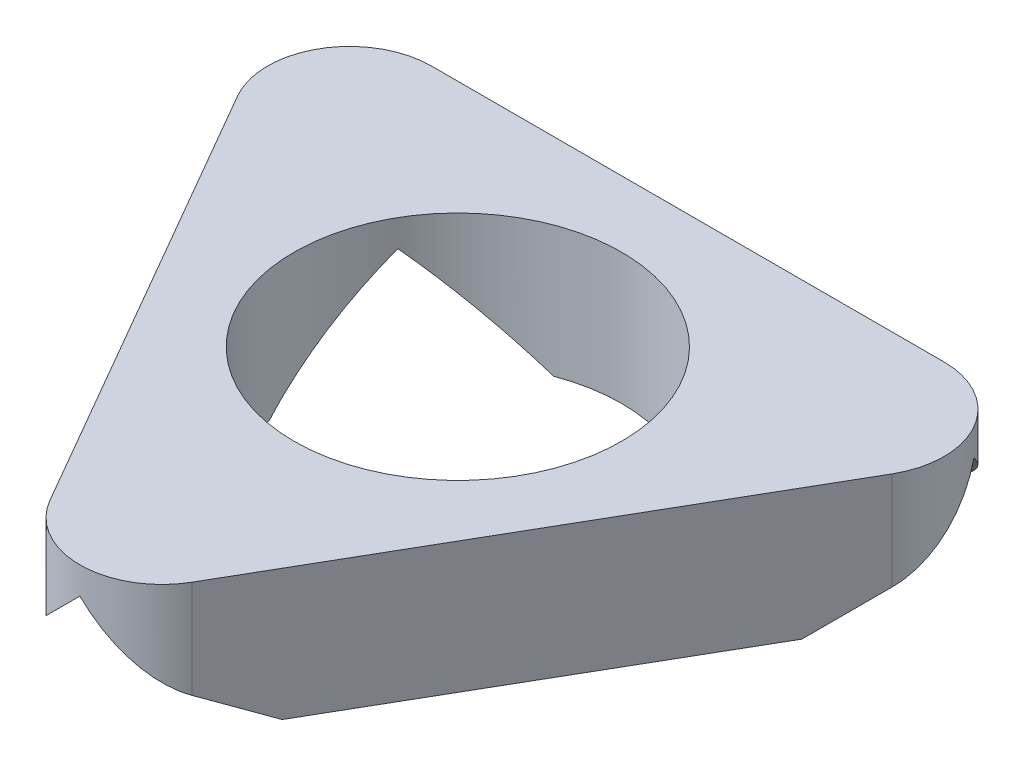
ISO-10303-21;
HEADER;
FILE_DESCRIPTION(('STEP AP214'),'2;1');
FILE_NAME('part.step','',(''),(''),'','','');
FILE_SCHEMA(('AUTOMOTIVE_DESIGN { 1 0 10303 214 1 1 1 1 }'));
ENDSEC;
DATA;
#1=APPLICATION_CONTEXT('core data for automotive mechanical design processes');
#2=APPLICATION_PROTOCOL_DEFINITION('international standard','automotive_design',2000,#1);
#3=PRODUCT_CONTEXT('',#1,'mechanical');
#4=PRODUCT('Part','Part','',(#3));
#5=PRODUCT_RELATED_PRODUCT_CATEGORY('part','',(#4));
#6=PRODUCT_DEFINITION_FORMATION('','',#4);
#7=PRODUCT_DEFINITION_CONTEXT('part definition',#1,'design');
#8=PRODUCT_DEFINITION('design','',#6,#7);
#9=PRODUCT_DEFINITION_SHAPE('','',#8);
#10=(LENGTH_UNIT() NAMED_UNIT(*) SI_UNIT(.MILLI.,.METRE.));
#11=(NAMED_UNIT(*) PLANE_ANGLE_UNIT() SI_UNIT($,.RADIAN.));
#12=(NAMED_UNIT(*) SI_UNIT($,.STERADIAN.) SOLID_ANGLE_UNIT());
#13=UNCERTAINTY_MEASURE_WITH_UNIT(LENGTH_MEASURE(1.E-05),#10,'distance_accuracy_value','');
#14=(GEOMETRIC_REPRESENTATION_CONTEXT(3) GLOBAL_UNCERTAINTY_ASSIGNED_CONTEXT((#13)) GLOBAL_UNIT_ASSIGNED_CONTEXT((#10,
#11,#12)) REPRESENTATION_CONTEXT('',''));
#15=CARTESIAN_POINT('',(0.,0.,0.));
#16=DIRECTION('',(0.,0.,1.));
#17=DIRECTION('',(1.,0.,0.));
#18=AXIS2_PLACEMENT_3D('',#15,#16,#17);
#19=CARTESIAN_POINT('',(-3.02097763799664,0.,-4.56619239928937));
#20=DIRECTION('',(0.,-1.,0.));
#21=DIRECTION('',(0.,0.,-1.));
#22=AXIS2_PLACEMENT_3D('',#19,#20,#21);
#23=PLANE('',#22);
#24=CARTESIAN_POINT('',(4.80389534308115,0.,-0.0484998772894646));
#25=DIRECTION('',(0.,1.,0.));
#26=DIRECTION('',(0.,0.,1.));
#27=AXIS2_PLACEMENT_3D('',#24,#25,#26);
#28=CIRCLE('',#27,5.);
#29=CARTESIAN_POINT('',(7.97889534308112,0.,3.81406080184558));
#30=VERTEX_POINT('',#29);
#31=CARTESIAN_POINT('',(9.73647101487096,0.,0.76985044015853));
#32=VERTEX_POINT('',#31);
#33=EDGE_CURVE('E253',#30,#32,#28,.T.);
#34=ORIENTED_EDGE('',*,*,#33,.T.);
#35=DIRECTION('',(-0.86602540378444,0.,0.499999999999998));
#36=VECTOR('',#35,1.);
#37=CARTESIAN_POINT('',(17.1738000788896,0.,-3.52409349700445));
#38=LINE('',#37,#36);
#39=CARTESIAN_POINT('',(13.7838953430815,0.,-1.56693108525845));
#40=VERTEX_POINT('',#39);
#41=EDGE_CURVE('E189',#40,#32,#38,.T.);
#42=ORIENTED_EDGE('',*,*,#41,.F.);
#43=DIRECTION('',(0.500000000000008,0.,-0.866025403784434));
#44=VECTOR('',#43,1.);
#45=CARTESIAN_POINT('',(6.96895885254223,0.,10.2368851667104));
#46=LINE('',#45,#44);
#47=CARTESIAN_POINT('',(7.97889534308109,0.,8.48762385267935));
#48=VERTEX_POINT('',#47);
#49=EDGE_CURVE('E183',#48,#40,#46,.T.);
#50=ORIENTED_EDGE('',*,*,#49,.F.);
#51=DIRECTION('',(0.,0.,-1.));
#52=VECTOR('',#51,1.);
#53=CARTESIAN_POINT('',(7.97889534308107,0.,11.4868851667105));
#54=LINE('',#53,#52);
#55=EDGE_CURVE('E46',#48,#30,#54,.T.);
#56=ORIENTED_EDGE('',*,*,#55,.T.);
#57=EDGE_LOOP('',(#34,#42,#50,#56));
#58=FACE_BOUND('',#57,.T.);
#59=ADVANCED_FACE('F31',(#58),#23,.T.);
#60=CARTESIAN_POINT('',(-0.12868032870865,0.,0.769850440158632));
#61=VERTEX_POINT('',#60);
#62=CARTESIAN_POINT('',(1.6288953430812,0.,3.8140608018456));
#63=VERTEX_POINT('',#62);
#64=EDGE_CURVE('E250',#61,#63,#28,.T.);
#65=ORIENTED_EDGE('',*,*,#64,.T.);
#66=DIRECTION('',(0.,0.,-1.));
#67=VECTOR('',#66,1.);
#68=CARTESIAN_POINT('',(1.62889534308115,0.,11.4868851667104));
#69=LINE('',#68,#67);
#70=CARTESIAN_POINT('',(1.62889534308117,0.,8.48762385267923));
#71=VERTEX_POINT('',#70);
#72=EDGE_CURVE('E279',#71,#63,#69,.T.);
#73=ORIENTED_EDGE('',*,*,#72,.F.);
#74=DIRECTION('',(0.499999999999998,0.,0.86602540378444));
#75=VECTOR('',#74,1.);
#76=CARTESIAN_POINT('',(-5.18604114745774,0.,-3.31619239928936));
#77=LINE('',#76,#75);
#78=CARTESIAN_POINT('',(-4.17610465691882,0.,-1.56693108525813));
#79=VERTEX_POINT('',#78);
#80=EDGE_CURVE('E191',#79,#71,#77,.T.);
#81=ORIENTED_EDGE('',*,*,#80,.F.);
#82=DIRECTION('',(0.86602540378444,0.,0.499999999999998));
#83=VECTOR('',#82,1.);
#84=CARTESIAN_POINT('',(-7.56600939272721,0.,-3.52409349700428));
#85=LINE('',#84,#83);
#86=EDGE_CURVE('E233',#79,#61,#85,.T.);
#87=ORIENTED_EDGE('',*,*,#86,.T.);
#88=EDGE_LOOP('',(#65,#73,#81,#87));
#89=FACE_BOUND('',#88,.T.);
#90=ADVANCED_FACE('F277',(#89),#23,.T.);
#91=CARTESIAN_POINT('',(4.80389534308115,4.,-0.0484998772894646));
#92=DIRECTION('',(0.,-1.,0.));
#93=DIRECTION('',(0.,0.,-1.));
#94=AXIS2_PLACEMENT_3D('',#91,#92,#93);
#95=CYLINDRICAL_SURFACE('',#94,5.);
#96=CARTESIAN_POINT('',(4.80389534308115,4.,-0.0484998772894646));
#97=DIRECTION('',(0.,1.,0.));
#98=DIRECTION('',(0.,0.,1.));
#99=AXIS2_PLACEMENT_3D('',#96,#97,#98);
#100=CIRCLE('',#99,5.);
#101=CARTESIAN_POINT('',(4.80389534308115,4.,4.95150012271054));
#102=VERTEX_POINT('',#101);
#103=EDGE_CURVE('E196',#102,#102,#100,.T.);
#104=ORIENTED_EDGE('',*,*,#103,.T.);
#105=EDGE_LOOP('',(#104));
#106=FACE_BOUND('',#105,.T.);
#107=CARTESIAN_POINT('',(4.80389534308115,3.17499999999998,-0.0484998772894646));
#108=DIRECTION('',(-0.353553390593271,0.70710678118655,-0.612372435695793));
#109=DIRECTION('',(-0.353553390593274,-0.707106781186545,-0.612372435695798));
#110=AXIS2_PLACEMENT_3D('',#107,#108,#109);
#111=ELLIPSE('',#110,7.07106781186545,5.);
#112=CARTESIAN_POINT('',(9.13402236200334,3.17499999999997,-2.54849987728946));
#113=VERTEX_POINT('',#112);
#114=CARTESIAN_POINT('',(6.56147101487095,0.,-4.72941087387256));
#115=VERTEX_POINT('',#114);
#116=EDGE_CURVE('E217',#113,#115,#111,.T.);
#117=ORIENTED_EDGE('',*,*,#116,.F.);
#118=CARTESIAN_POINT('',(4.80389534308115,3.17499999999995,-0.0484998772894646));
#119=DIRECTION('',(-0.353553390593274,-0.707106781186544,-0.612372435695798));
#120=DIRECTION('',(0.353553390593271,-0.707106781186551,0.612372435695792));
#121=AXIS2_PLACEMENT_3D('',#118,#119,#120);
#122=ELLIPSE('',#121,7.07106781186551,5.);
#123=EDGE_CURVE('E146',#113,#32,#122,.T.);
#124=ORIENTED_EDGE('',*,*,#123,.T.);
#125=ORIENTED_EDGE('',*,*,#33,.F.);
#126=CARTESIAN_POINT('',(4.80389534308115,3.17499999999998,-0.0484998772894646));
#127=DIRECTION('',(0.707106781186545,0.70710678118655,0.));
#128=DIRECTION('',(0.70710678118655,-0.707106781186545,0.));
#129=AXIS2_PLACEMENT_3D('',#126,#127,#128);
#130=ELLIPSE('',#129,7.07106781186545,5.);
#131=CARTESIAN_POINT('',(4.80389534308112,3.17499999999997,4.95150012271054));
#132=VERTEX_POINT('',#131);
#133=EDGE_CURVE('E145',#132,#30,#130,.T.);
#134=ORIENTED_EDGE('',*,*,#133,.F.);
#135=CARTESIAN_POINT('',(4.80389534308115,3.17499999999995,-0.0484998772894646));
#136=DIRECTION('',(0.707106781186551,-0.707106781186544,0.));
#137=DIRECTION('',(-0.707106781186544,-0.707106781186551,0.));
#138=AXIS2_PLACEMENT_3D('',#135,#136,#137);
#139=ELLIPSE('',#138,7.07106781186551,5.);
#140=EDGE_CURVE('E152',#132,#63,#139,.T.);
#141=ORIENTED_EDGE('',*,*,#140,.T.);
#142=ORIENTED_EDGE('',*,*,#64,.F.);
#143=CARTESIAN_POINT('',(4.80389534308115,3.17499999999998,-0.0484998772894646));
#144=DIRECTION('',(-0.353553390593271,0.70710678118655,0.612372435695793));
#145=DIRECTION('',(-0.353553390593274,-0.707106781186545,0.612372435695798));
#146=AXIS2_PLACEMENT_3D('',#143,#144,#145);
#147=ELLIPSE('',#146,7.07106781186545,5.);
#148=CARTESIAN_POINT('',(0.473768324158944,3.17499999999997,-2.54849987728944));
#149=VERTEX_POINT('',#148);
#150=EDGE_CURVE('E165',#149,#61,#147,.T.);
#151=ORIENTED_EDGE('',*,*,#150,.F.);
#152=CARTESIAN_POINT('',(4.80389534308115,3.17499999999995,-0.0484998772894646));
#153=DIRECTION('',(-0.353553390593274,-0.707106781186544,0.612372435695798));
#154=DIRECTION('',(0.35355339059327,-0.707106781186551,-0.612372435695793));
#155=AXIS2_PLACEMENT_3D('',#152,#153,#154);
#156=ELLIPSE('',#155,7.07106781186551,5.);
#157=CARTESIAN_POINT('',(3.04631967129124,0.,-4.72941087387253));
#158=VERTEX_POINT('',#157);
#159=EDGE_CURVE('E172',#149,#158,#156,.T.);
#160=ORIENTED_EDGE('',*,*,#159,.T.);
#161=EDGE_CURVE('E247',#115,#158,#28,.T.);
#162=ORIENTED_EDGE('',*,*,#161,.F.);
#163=EDGE_LOOP('',(#117,#124,#125,#134,#141,#142,#151,#160,#162));
#164=FACE_BOUND('',#163,.T.);
#165=ADVANCED_FACE('F301',(#106,#164),#95,.F.);
#166=CARTESIAN_POINT('',(-5.18604114745774,4.,-3.31619239928936));
#167=DIRECTION('',(0.86602540378444,0.,-0.499999999999998));
#168=DIRECTION('',(-0.499999999999998,0.,-0.86602540378444));
#169=AXIS2_PLACEMENT_3D('',#166,#167,#168);
#170=PLANE('',#169);
#171=DIRECTION('',(-0.447213595499954,-0.447213595499964,-0.774596669241482));
#172=VECTOR('',#171,1.);
#173=CARTESIAN_POINT('',(-3.02305384934992,-4.65194919243119,0.430211497159538));
#174=LINE('',#173,#172);
#175=CARTESIAN_POINT('',(2.63883183362005,1.0099364905389,10.2368851667104));
#176=VERTEX_POINT('',#175);
#177=EDGE_CURVE('E225',#176,#71,#174,.T.);
#178=ORIENTED_EDGE('',*,*,#177,.F.);
#179=DIRECTION('',(0.,-1.,0.));
#180=VECTOR('',#179,1.);
#181=CARTESIAN_POINT('',(2.63883183362005,4.,10.2368851667104));
#182=LINE('',#181,#180);
#183=CARTESIAN_POINT('',(2.63883183362005,4.,10.2368851667104));
#184=VERTEX_POINT('',#183);
#185=EDGE_CURVE('E158',#184,#176,#182,.T.);
#186=ORIENTED_EDGE('',*,*,#185,.F.);
#187=DIRECTION('',(0.499999999999998,0.,0.86602540378444));
#188=VECTOR('',#187,1.);
#189=CARTESIAN_POINT('',(-5.18604114745774,4.,-3.31619239928936));
#190=LINE('',#189,#188);
#191=CARTESIAN_POINT('',(-5.18604114745774,4.,-3.31619239928936));
#192=VERTEX_POINT('',#191);
#193=EDGE_CURVE('E256',#192,#184,#190,.T.);
#194=ORIENTED_EDGE('',*,*,#193,.F.);
#195=DIRECTION('',(0.,-1.,0.));
#196=VECTOR('',#195,1.);
#197=CARTESIAN_POINT('',(-5.18604114745774,4.,-3.31619239928936));
#198=LINE('',#197,#196);
#199=CARTESIAN_POINT('',(-5.18604114745774,1.00993649053893,-3.31619239928936));
#200=VERTEX_POINT('',#199);
#201=EDGE_CURVE('E161',#192,#200,#198,.T.);
#202=ORIENTED_EDGE('',*,*,#201,.T.);
#203=DIRECTION('',(0.447213595499956,-0.447213595499958,0.774596669241484));
#204=VECTOR('',#203,1.);
#205=CARTESIAN_POINT('',(-5.78405384934995,1.60794919243115,-4.35198078253822));
#206=LINE('',#205,#204);
#207=EDGE_CURVE('E232',#200,#79,#206,.T.);
#208=ORIENTED_EDGE('',*,*,#207,.T.);
#209=ORIENTED_EDGE('',*,*,#80,.T.);
#210=EDGE_LOOP('',(#178,#186,#194,#202,#208,#209));
#211=FACE_BOUND('',#210,.T.);
#212=ADVANCED_FACE('F272',(#211),#170,.F.);
#213=CARTESIAN_POINT('',(4.80389534308117,4.,8.98688516671035));
#214=DIRECTION('',(0.,-1.,0.));
#215=DIRECTION('',(0.,0.,-1.));
#216=AXIS2_PLACEMENT_3D('',#213,#214,#215);
#217=CYLINDRICAL_SURFACE('',#216,2.50000000000002);
#218=CARTESIAN_POINT('',(4.80389534308117,3.17500000000004,8.98688516671035));
#219=DIRECTION('',(0.707106781186551,-0.707106781186544,0.));
#220=DIRECTION('',(-0.707106781186544,-0.707106781186551,0.));
#221=AXIS2_PLACEMENT_3D('',#218,#219,#220);
#222=ELLIPSE('',#221,3.53553390593279,2.50000000000002);
#223=CARTESIAN_POINT('',(4.80389534308108,3.17499999999997,11.4868851667104));
#224=VERTEX_POINT('',#223);
#225=EDGE_CURVE('E11',#224,#176,#222,.T.);
#226=ORIENTED_EDGE('',*,*,#225,.F.);
#227=CARTESIAN_POINT('',(4.80389534308117,3.17499999999989,8.98688516671035));
#228=DIRECTION('',(0.707106781186545,0.70710678118655,0.));
#229=DIRECTION('',(0.70710678118655,-0.707106781186545,0.));
#230=AXIS2_PLACEMENT_3D('',#227,#228,#229);
#231=ELLIPSE('',#230,3.53553390593276,2.50000000000002);
#232=CARTESIAN_POINT('',(6.96895885254223,1.00993649053884,10.2368851667104));
#233=VERTEX_POINT('',#232);
#234=EDGE_CURVE('E136',#224,#233,#231,.T.);
#235=ORIENTED_EDGE('',*,*,#234,.T.);
#236=DIRECTION('',(0.,-1.,0.));
#237=VECTOR('',#236,1.);
#238=CARTESIAN_POINT('',(6.96895885254225,4.,10.2368851667104));
#239=LINE('',#238,#237);
#240=CARTESIAN_POINT('',(6.96895885254225,4.,10.2368851667104));
#241=VERTEX_POINT('',#240);
#242=EDGE_CURVE('E162',#241,#233,#239,.T.);
#243=ORIENTED_EDGE('',*,*,#242,.F.);
#244=CARTESIAN_POINT('',(4.80389534308117,4.,8.98688516671035));
#245=DIRECTION('',(0.,1.,0.));
#246=DIRECTION('',(0.,0.,-1.));
#247=AXIS2_PLACEMENT_3D('',#244,#245,#246);
#248=CIRCLE('',#247,2.50000000000002);
#249=EDGE_CURVE('E159',#184,#241,#248,.T.);
#250=ORIENTED_EDGE('',*,*,#249,.F.);
#251=ORIENTED_EDGE('',*,*,#185,.T.);
#252=EDGE_LOOP('',(#226,#235,#243,#250,#251));
#253=FACE_BOUND('',#252,.T.);
#254=ADVANCED_FACE('F155',(#253),#217,.T.);
#255=CARTESIAN_POINT('',(6.96895885254223,4.,10.2368851667104));
#256=DIRECTION('',(-0.866025403784434,0.,-0.500000000000008));
#257=DIRECTION('',(-0.500000000000008,0.,0.866025403784434));
#258=AXIS2_PLACEMENT_3D('',#255,#256,#257);
#259=PLANE('',#258);
#260=DIRECTION('',(-0.447213595499966,-0.447213595499957,0.77459666924148));
#261=VECTOR('',#260,1.);
#262=CARTESIAN_POINT('',(9.13194615065009,-4.65194919243131,6.49048127026156));
#263=LINE('',#262,#261);
#264=CARTESIAN_POINT('',(14.7938318336202,1.00993649053874,-3.31619239928935));
#265=VERTEX_POINT('',#264);
#266=EDGE_CURVE('E215',#265,#40,#263,.T.);
#267=ORIENTED_EDGE('',*,*,#266,.F.);
#268=DIRECTION('',(0.,-1.,0.));
#269=VECTOR('',#268,1.);
#270=CARTESIAN_POINT('',(14.7938318336202,4.,-3.31619239928935));
#271=LINE('',#270,#269);
#272=CARTESIAN_POINT('',(14.7938318336202,4.,-3.31619239928935));
#273=VERTEX_POINT('',#272);
#274=EDGE_CURVE('E167',#273,#265,#271,.T.);
#275=ORIENTED_EDGE('',*,*,#274,.F.);
#276=DIRECTION('',(0.500000000000008,0.,-0.866025403784434));
#277=VECTOR('',#276,1.);
#278=CARTESIAN_POINT('',(6.96895885254223,4.,10.2368851667104));
#279=LINE('',#278,#277);
#280=EDGE_CURVE('E214',#241,#273,#279,.T.);
#281=ORIENTED_EDGE('',*,*,#280,.F.);
#282=ORIENTED_EDGE('',*,*,#242,.T.);
#283=DIRECTION('',(0.447213595499966,-0.447213595499957,-0.77459666924148));
#284=VECTOR('',#283,1.);
#285=CARTESIAN_POINT('',(6.37094615064999,1.60794919243107,11.2726735499593));
#286=LINE('',#285,#284);
#287=EDGE_CURVE('E39',#233,#48,#286,.T.);
#288=ORIENTED_EDGE('',*,*,#287,.T.);
#289=ORIENTED_EDGE('',*,*,#49,.T.);
#290=EDGE_LOOP('',(#267,#275,#281,#282,#288,#289));
#291=FACE_BOUND('',#290,.T.);
#292=ADVANCED_FACE('F182',(#291),#259,.F.);
#293=CARTESIAN_POINT('',(12.6287683241592,4.,-4.56619239928939));
#294=DIRECTION('',(0.,-1.,0.));
#295=DIRECTION('',(0.,0.,-1.));
#296=AXIS2_PLACEMENT_3D('',#293,#294,#295);
#297=CYLINDRICAL_SURFACE('',#296,2.5);
#298=CARTESIAN_POINT('',(12.6287683241592,3.17499999999989,-4.56619239928939));
#299=DIRECTION('',(-0.353553390593274,-0.707106781186544,-0.612372435695798));
#300=DIRECTION('',(0.353553390593271,-0.707106781186551,0.612372435695792));
#301=AXIS2_PLACEMENT_3D('',#298,#299,#300);
#302=ELLIPSE('',#301,3.53553390593275,2.5);
#303=CARTESIAN_POINT('',(14.7938318336202,3.17499999999997,-5.81619239928945));
#304=VERTEX_POINT('',#303);
#305=EDGE_CURVE('E177',#304,#265,#302,.T.);
#306=ORIENTED_EDGE('',*,*,#305,.F.);
#307=CARTESIAN_POINT('',(12.6287683241592,3.17500000000004,-4.56619239928939));
#308=DIRECTION('',(-0.353553390593271,0.70710678118655,-0.612372435695793));
#309=DIRECTION('',(-0.353553390593274,-0.707106781186545,-0.612372435695798));
#310=AXIS2_PLACEMENT_3D('',#307,#308,#309);
#311=ELLIPSE('',#310,3.53553390593272,2.5);
#312=CARTESIAN_POINT('',(12.6287683241592,1.00993649053897,-7.06619239928939));
#313=VERTEX_POINT('',#312);
#314=EDGE_CURVE('E175',#304,#313,#311,.T.);
#315=ORIENTED_EDGE('',*,*,#314,.T.);
#316=DIRECTION('',(0.,-1.,0.));
#317=VECTOR('',#316,1.);
#318=CARTESIAN_POINT('',(12.6287683241592,4.,-7.06619239928939));
#319=LINE('',#318,#317);
#320=CARTESIAN_POINT('',(12.6287683241592,4.,-7.06619239928939));
#321=VERTEX_POINT('',#320);
#322=EDGE_CURVE('E203',#321,#313,#319,.T.);
#323=ORIENTED_EDGE('',*,*,#322,.F.);
#324=CARTESIAN_POINT('',(12.6287683241592,4.,-4.56619239928939));
#325=DIRECTION('',(0.,1.,0.));
#326=DIRECTION('',(0.,0.,-1.));
#327=AXIS2_PLACEMENT_3D('',#324,#325,#326);
#328=CIRCLE('',#327,2.5);
#329=EDGE_CURVE('E213',#273,#321,#328,.T.);
#330=ORIENTED_EDGE('',*,*,#329,.F.);
#331=ORIENTED_EDGE('',*,*,#274,.T.);
#332=EDGE_LOOP('',(#306,#315,#323,#330,#331));
#333=FACE_BOUND('',#332,.T.);
#334=ADVANCED_FACE('F211',(#333),#297,.T.);
#335=DIRECTION('',(-0.86602540378444,0.,0.499999999999998));
#336=VECTOR('',#335,1.);
#337=CARTESIAN_POINT('',(13.9988000788897,0.,-9.02335481103558));
#338=LINE('',#337,#336);
#339=CARTESIAN_POINT('',(10.6088953430812,0.,-7.06619239928937));
#340=VERTEX_POINT('',#339);
#341=EDGE_CURVE('E283',#340,#115,#338,.T.);
#342=ORIENTED_EDGE('',*,*,#341,.T.);
#343=ORIENTED_EDGE('',*,*,#161,.T.);
#344=DIRECTION('',(0.86602540378444,0.,0.499999999999998));
#345=VECTOR('',#344,1.);
#346=CARTESIAN_POINT('',(-4.39100939272726,0.,-9.02335481103541));
#347=LINE('',#346,#345);
#348=CARTESIAN_POINT('',(-1.00110465691905,0.,-7.06619239928936));
#349=VERTEX_POINT('',#348);
#350=EDGE_CURVE('E229',#349,#158,#347,.T.);
#351=ORIENTED_EDGE('',*,*,#350,.F.);
#352=DIRECTION('',(-1.,0.,0.));
#353=VECTOR('',#352,1.);
#354=CARTESIAN_POINT('',(12.6287683241592,0.,-7.06619239928937));
#355=LINE('',#354,#353);
#356=EDGE_CURVE('E190',#340,#349,#355,.T.);
#357=ORIENTED_EDGE('',*,*,#356,.F.);
#358=EDGE_LOOP('',(#342,#343,#351,#357));
#359=FACE_BOUND('',#358,.T.);
#360=ADVANCED_FACE('F292',(#359),#23,.T.);
#361=CARTESIAN_POINT('',(-3.02097763799664,4.,-4.56619239928937));
#362=DIRECTION('',(0.,-1.,0.));
#363=DIRECTION('',(0.,0.,-1.));
#364=AXIS2_PLACEMENT_3D('',#361,#362,#363);
#365=CYLINDRICAL_SURFACE('',#364,2.5);
#366=CARTESIAN_POINT('',(-3.02097763799664,3.17499999999991,-4.56619239928937));
#367=DIRECTION('',(-0.353553390593274,-0.707106781186544,0.612372435695798));
#368=DIRECTION('',(0.35355339059327,-0.707106781186551,-0.612372435695793));
#369=AXIS2_PLACEMENT_3D('',#366,#367,#368);
#370=ELLIPSE('',#369,3.53553390593275,2.5);
#371=CARTESIAN_POINT('',(-5.18604114745776,3.17499999999997,-5.81619239928932));
#372=VERTEX_POINT('',#371);
#373=CARTESIAN_POINT('',(-3.02097763799664,1.0099364905388,-7.06619239928936));
#374=VERTEX_POINT('',#373);
#375=EDGE_CURVE('E245',#372,#374,#370,.T.);
#376=ORIENTED_EDGE('',*,*,#375,.F.);
#377=CARTESIAN_POINT('',(-3.02097763799664,3.17500000000002,-4.56619239928937));
#378=DIRECTION('',(-0.353553390593271,0.70710678118655,0.612372435695793));
#379=DIRECTION('',(-0.353553390593274,-0.707106781186545,0.612372435695798));
#380=AXIS2_PLACEMENT_3D('',#377,#378,#379);
#381=ELLIPSE('',#380,3.53553390593272,2.5);
#382=EDGE_CURVE('E239',#372,#200,#381,.T.);
#383=ORIENTED_EDGE('',*,*,#382,.T.);
#384=ORIENTED_EDGE('',*,*,#201,.F.);
#385=CARTESIAN_POINT('',(-3.02097763799664,4.,-4.56619239928937));
#386=DIRECTION('',(0.,1.,0.));
#387=DIRECTION('',(0.,0.,-1.));
#388=AXIS2_PLACEMENT_3D('',#385,#386,#387);
#389=CIRCLE('',#388,2.5);
#390=CARTESIAN_POINT('',(-3.02097763799665,4.,-7.06619239928936));
#391=VERTEX_POINT('',#390);
#392=EDGE_CURVE('E193',#391,#192,#389,.T.);
#393=ORIENTED_EDGE('',*,*,#392,.F.);
#394=DIRECTION('',(0.,-1.,0.));
#395=VECTOR('',#394,1.);
#396=CARTESIAN_POINT('',(-3.02097763799665,4.,-7.06619239928936));
#397=LINE('',#396,#395);
#398=EDGE_CURVE('E200',#391,#374,#397,.T.);
#399=ORIENTED_EDGE('',*,*,#398,.T.);
#400=EDGE_LOOP('',(#376,#383,#384,#393,#399));
#401=FACE_BOUND('',#400,.T.);
#402=ADVANCED_FACE('F33',(#401),#365,.T.);
#403=CARTESIAN_POINT('',(12.6287683241592,4.,-7.06619239928937));
#404=DIRECTION('',(0.,0.,1.));
#405=DIRECTION('',(1.,0.,0.));
#406=AXIS2_PLACEMENT_3D('',#403,#404,#405);
#407=PLANE('',#406);
#408=ORIENTED_EDGE('',*,*,#322,.T.);
#409=DIRECTION('',(-0.894427190999918,-0.447213595499954,0.));
#410=VECTOR('',#409,1.);
#411=CARTESIAN_POINT('',(13.8247937279436,1.60794919243118,-7.06619239928937));
#412=LINE('',#411,#410);
#413=EDGE_CURVE('E54',#313,#340,#412,.T.);
#414=ORIENTED_EDGE('',*,*,#413,.T.);
#415=ORIENTED_EDGE('',*,*,#356,.T.);
#416=DIRECTION('',(0.894427190999915,-0.44721359549996,0.));
#417=VECTOR('',#416,1.);
#418=CARTESIAN_POINT('',(8.30279372794349,-4.6519491924313,-7.06619239928937));
#419=LINE('',#418,#417);
#420=EDGE_CURVE('E242',#374,#349,#419,.T.);
#421=ORIENTED_EDGE('',*,*,#420,.F.);
#422=ORIENTED_EDGE('',*,*,#398,.F.);
#423=DIRECTION('',(-1.,0.,0.));
#424=VECTOR('',#423,1.);
#425=CARTESIAN_POINT('',(12.6287683241592,4.,-7.06619239928937));
#426=LINE('',#425,#424);
#427=EDGE_CURVE('E204',#321,#391,#426,.T.);
#428=ORIENTED_EDGE('',*,*,#427,.F.);
#429=EDGE_LOOP('',(#408,#414,#415,#421,#422,#428));
#430=FACE_BOUND('',#429,.T.);
#431=ADVANCED_FACE('F269',(#430),#407,.F.);
#432=CARTESIAN_POINT('',(-3.02097763799664,4.,-4.56619239928937));
#433=DIRECTION('',(0.,-1.,0.));
#434=DIRECTION('',(0.,0.,-1.));
#435=AXIS2_PLACEMENT_3D('',#432,#433,#434);
#436=PLANE('',#435);
#437=ORIENTED_EDGE('',*,*,#392,.T.);
#438=ORIENTED_EDGE('',*,*,#193,.T.);
#439=ORIENTED_EDGE('',*,*,#249,.T.);
#440=ORIENTED_EDGE('',*,*,#280,.T.);
#441=ORIENTED_EDGE('',*,*,#329,.T.);
#442=ORIENTED_EDGE('',*,*,#427,.T.);
#443=EDGE_LOOP('',(#437,#438,#439,#440,#441,#442));
#444=FACE_BOUND('',#443,.T.);
#445=ORIENTED_EDGE('',*,*,#103,.F.);
#446=EDGE_LOOP('',(#445));
#447=FACE_BOUND('',#446,.T.);
#448=ADVANCED_FACE('F263',(#444,#447),#436,.F.);
#449=CARTESIAN_POINT('',(-2.74403308982922,-3.29395260579613,-11.8760014465168));
#450=DIRECTION('',(-0.353553390593274,-0.707106781186544,0.612372435695798));
#451=DIRECTION('',(0.,-0.654653670707981,-0.755928946018451));
#452=AXIS2_PLACEMENT_3D('',#449,#450,#451);
#453=PLANE('',#452);
#454=ORIENTED_EDGE('',*,*,#375,.T.);
#455=ORIENTED_EDGE('',*,*,#420,.T.);
#456=ORIENTED_EDGE('',*,*,#350,.T.);
#457=ORIENTED_EDGE('',*,*,#159,.F.);
#458=DIRECTION('',(0.86602540378444,0.,0.499999999999998));
#459=VECTOR('',#458,1.);
#460=CARTESIAN_POINT('',(-5.97850939272722,3.17499999999997,-6.27372415401987));
#461=LINE('',#460,#459);
#462=EDGE_CURVE('E228',#372,#149,#461,.T.);
#463=ORIENTED_EDGE('',*,*,#462,.F.);
#464=EDGE_LOOP('',(#454,#455,#456,#457,#463));
#465=FACE_BOUND('',#464,.T.);
#466=ADVANCED_FACE('F296',(#465),#453,.T.);
#467=CARTESIAN_POINT('',(-2.8766011475448,9.3788164903648,-11.6463868350927));
#468=DIRECTION('',(-0.353553390593271,0.70710678118655,0.612372435695793));
#469=DIRECTION('',(0.,-0.654653670707975,0.755928946018457));
#470=AXIS2_PLACEMENT_3D('',#467,#468,#469);
#471=PLANE('',#470);
#472=ORIENTED_EDGE('',*,*,#462,.T.);
#473=ORIENTED_EDGE('',*,*,#150,.T.);
#474=ORIENTED_EDGE('',*,*,#86,.F.);
#475=ORIENTED_EDGE('',*,*,#207,.F.);
#476=ORIENTED_EDGE('',*,*,#382,.F.);
#477=EDGE_LOOP('',(#472,#473,#474,#475,#476));
#478=FACE_BOUND('',#477,.T.);
#479=ADVANCED_FACE('F302',(#478),#471,.F.);
#480=CARTESIAN_POINT('',(18.6882083240721,9.3788164903648,-0.901061472947185));
#481=DIRECTION('',(-0.353553390593271,0.70710678118655,-0.612372435695793));
#482=DIRECTION('',(0.,0.654653670707974,0.755928946018457));
#483=AXIS2_PLACEMENT_3D('',#480,#481,#482);
#484=PLANE('',#483);
#485=ORIENTED_EDGE('',*,*,#116,.T.);
#486=ORIENTED_EDGE('',*,*,#341,.F.);
#487=ORIENTED_EDGE('',*,*,#413,.F.);
#488=ORIENTED_EDGE('',*,*,#314,.F.);
#489=DIRECTION('',(-0.86602540378444,0.,0.499999999999998));
#490=VECTOR('',#489,1.);
#491=CARTESIAN_POINT('',(15.5863000788897,3.17499999999997,-6.27372415401999));
#492=LINE('',#491,#490);
#493=EDGE_CURVE('E280',#304,#113,#492,.T.);
#494=ORIENTED_EDGE('',*,*,#493,.T.);
#495=EDGE_LOOP('',(#485,#486,#487,#488,#494));
#496=FACE_BOUND('',#495,.T.);
#497=ADVANCED_FACE('F304',(#496),#484,.F.);
#498=CARTESIAN_POINT('',(18.8207763817877,-3.29395260579613,-0.671446861523079));
#499=DIRECTION('',(-0.353553390593274,-0.707106781186544,-0.612372435695798));
#500=DIRECTION('',(0.,0.654653670707981,-0.755928946018451));
#501=AXIS2_PLACEMENT_3D('',#498,#499,#500);
#502=PLANE('',#501);
#503=ORIENTED_EDGE('',*,*,#493,.F.);
#504=ORIENTED_EDGE('',*,*,#305,.T.);
#505=ORIENTED_EDGE('',*,*,#266,.T.);
#506=ORIENTED_EDGE('',*,*,#41,.T.);
#507=ORIENTED_EDGE('',*,*,#123,.F.);
#508=EDGE_LOOP('',(#503,#504,#505,#506,#507));
#509=FACE_BOUND('',#508,.T.);
#510=ADVANCED_FACE('F310',(#509),#502,.T.);
#511=CARTESIAN_POINT('',(-1.66505726271495,-3.29395260579613,11.4868851667104));
#512=DIRECTION('',(0.707106781186551,-0.707106781186544,0.));
#513=DIRECTION('',(0.707106781186544,0.707106781186551,0.));
#514=AXIS2_PLACEMENT_3D('',#511,#512,#513);
#515=PLANE('',#514);
#516=DIRECTION('',(0.,0.,-1.));
#517=VECTOR('',#516,1.);
#518=CARTESIAN_POINT('',(4.80389534308108,3.17499999999997,11.4868851667104));
#519=LINE('',#518,#517);
#520=EDGE_CURVE('E139',#224,#132,#519,.T.);
#521=ORIENTED_EDGE('',*,*,#520,.F.);
#522=ORIENTED_EDGE('',*,*,#225,.T.);
#523=ORIENTED_EDGE('',*,*,#177,.T.);
#524=ORIENTED_EDGE('',*,*,#72,.T.);
#525=ORIENTED_EDGE('',*,*,#140,.F.);
#526=EDGE_LOOP('',(#521,#522,#523,#524,#525));
#527=FACE_BOUND('',#526,.T.);
#528=ADVANCED_FACE('F149',(#527),#515,.T.);
#529=CARTESIAN_POINT('',(-1.3999211472838,9.3788164903648,11.4868851667104));
#530=DIRECTION('',(0.707106781186545,0.70710678118655,0.));
#531=DIRECTION('',(-0.70710678118655,0.707106781186545,0.));
#532=AXIS2_PLACEMENT_3D('',#529,#530,#531);
#533=PLANE('',#532);
#534=ORIENTED_EDGE('',*,*,#133,.T.);
#535=ORIENTED_EDGE('',*,*,#55,.F.);
#536=ORIENTED_EDGE('',*,*,#287,.F.);
#537=ORIENTED_EDGE('',*,*,#234,.F.);
#538=ORIENTED_EDGE('',*,*,#520,.T.);
#539=EDGE_LOOP('',(#534,#535,#536,#537,#538));
#540=FACE_BOUND('',#539,.T.);
#541=ADVANCED_FACE('F138',(#540),#533,.F.);
#542=CLOSED_SHELL('',(#59,#90,#165,#212,#254,#292,#334,#360,#402,#431,#448,#466,#479,#497,#510,
#528,#541));
#543=MANIFOLD_SOLID_BREP('B2',#542);
#544=ADVANCED_BREP_SHAPE_REPRESENTATION('',(#18,#543),#14);
#545=SHAPE_DEFINITION_REPRESENTATION(#9,#544);
ENDSEC;
END-ISO-10303-21;
